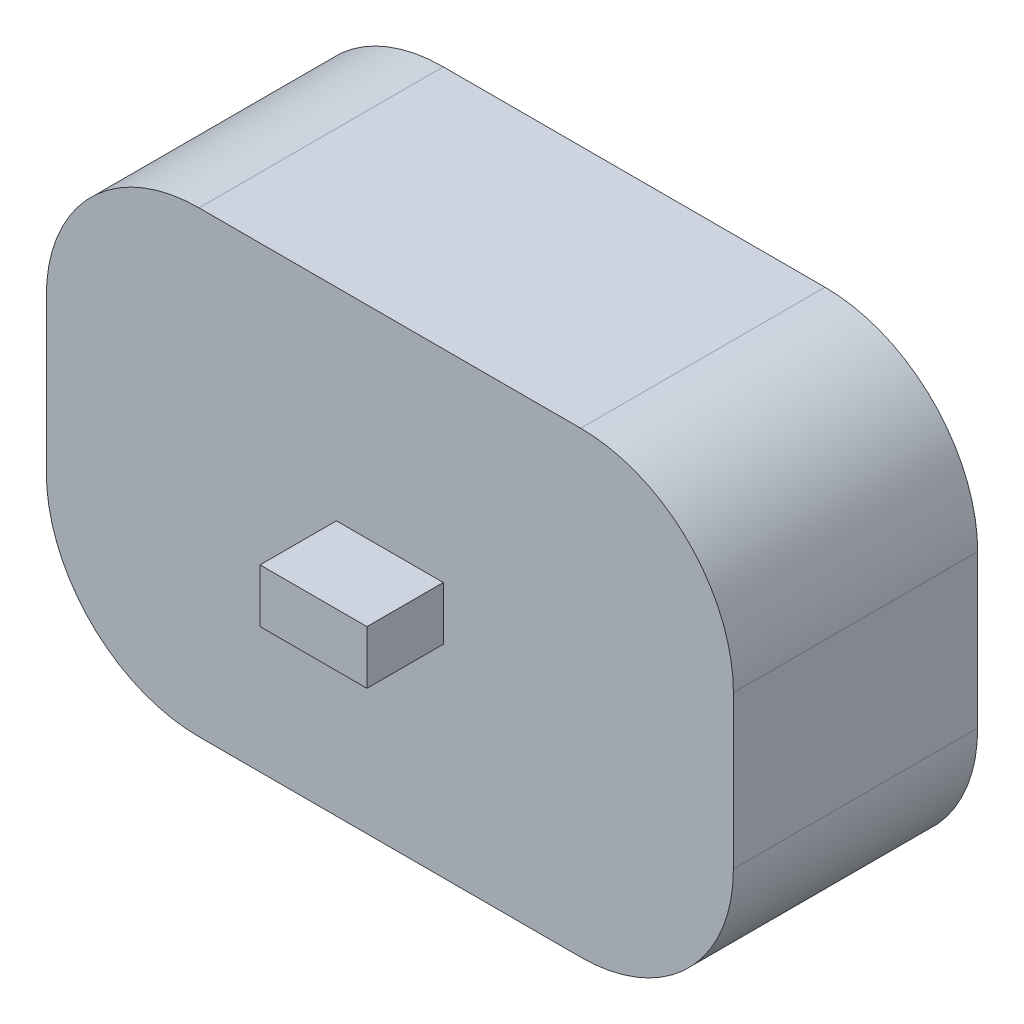
ISO-10303-21;
HEADER;
FILE_DESCRIPTION(('STEP AP214'),'2;1');
FILE_NAME('part.step','',(''),(''),'','','');
FILE_SCHEMA(('AUTOMOTIVE_DESIGN { 1 0 10303 214 1 1 1 1 }'));
ENDSEC;
DATA;
#1=APPLICATION_CONTEXT('core data for automotive mechanical design processes');
#2=APPLICATION_PROTOCOL_DEFINITION('international standard','automotive_design',2000,#1);
#3=PRODUCT_CONTEXT('',#1,'mechanical');
#4=PRODUCT('Part','Part','',(#3));
#5=PRODUCT_RELATED_PRODUCT_CATEGORY('part','',(#4));
#6=PRODUCT_DEFINITION_FORMATION('','',#4);
#7=PRODUCT_DEFINITION_CONTEXT('part definition',#1,'design');
#8=PRODUCT_DEFINITION('design','',#6,#7);
#9=PRODUCT_DEFINITION_SHAPE('','',#8);
#10=(LENGTH_UNIT() NAMED_UNIT(*) SI_UNIT(.MILLI.,.METRE.));
#11=(NAMED_UNIT(*) PLANE_ANGLE_UNIT() SI_UNIT($,.RADIAN.));
#12=(NAMED_UNIT(*) SI_UNIT($,.STERADIAN.) SOLID_ANGLE_UNIT());
#13=UNCERTAINTY_MEASURE_WITH_UNIT(LENGTH_MEASURE(1.E-05),#10,'distance_accuracy_value','');
#14=(GEOMETRIC_REPRESENTATION_CONTEXT(3) GLOBAL_UNCERTAINTY_ASSIGNED_CONTEXT((#13)) GLOBAL_UNIT_ASSIGNED_CONTEXT((#10,
#11,#12)) REPRESENTATION_CONTEXT('',''));
#15=CARTESIAN_POINT('',(0.,0.,0.));
#16=DIRECTION('',(0.,0.,1.));
#17=DIRECTION('',(1.,0.,0.));
#18=AXIS2_PLACEMENT_3D('',#15,#16,#17);
#19=CARTESIAN_POINT('',(22.5,-15.,16.));
#20=DIRECTION('',(-1.,0.,0.));
#21=DIRECTION('',(0.,0.,1.));
#22=AXIS2_PLACEMENT_3D('',#19,#20,#21);
#23=PLANE('',#22);
#24=DIRECTION('',(0.,1.,0.));
#25=VECTOR('',#24,1.);
#26=CARTESIAN_POINT('',(22.5,-15.,0.));
#27=LINE('',#26,#25);
#28=CARTESIAN_POINT('',(22.5,-5.,0.));
#29=VERTEX_POINT('',#28);
#30=CARTESIAN_POINT('',(22.5,5.,0.));
#31=VERTEX_POINT('',#30);
#32=EDGE_CURVE('E162',#29,#31,#27,.T.);
#33=ORIENTED_EDGE('',*,*,#32,.T.);
#34=DIRECTION('',(0.,0.,-1.));
#35=VECTOR('',#34,1.);
#36=CARTESIAN_POINT('',(22.5,5.,16.));
#37=LINE('',#36,#35);
#38=CARTESIAN_POINT('',(22.5,5.,16.));
#39=VERTEX_POINT('',#38);
#40=EDGE_CURVE('E215',#31,#39,#37,.F.);
#41=ORIENTED_EDGE('',*,*,#40,.T.);
#42=DIRECTION('',(0.,1.,0.));
#43=VECTOR('',#42,1.);
#44=CARTESIAN_POINT('',(22.5,-15.,16.));
#45=LINE('',#44,#43);
#46=CARTESIAN_POINT('',(22.5,-5.,16.));
#47=VERTEX_POINT('',#46);
#48=EDGE_CURVE('E167',#47,#39,#45,.T.);
#49=ORIENTED_EDGE('',*,*,#48,.F.);
#50=DIRECTION('',(0.,0.,-1.));
#51=VECTOR('',#50,1.);
#52=CARTESIAN_POINT('',(22.5,-5.,16.));
#53=LINE('',#52,#51);
#54=EDGE_CURVE('E212',#47,#29,#53,.T.);
#55=ORIENTED_EDGE('',*,*,#54,.T.);
#56=EDGE_LOOP('',(#33,#41,#49,#55));
#57=FACE_BOUND('',#56,.T.);
#58=ADVANCED_FACE('F36',(#57),#23,.F.);
#59=CARTESIAN_POINT('',(-22.5,15.,16.));
#60=DIRECTION('',(0.,-1.,0.));
#61=DIRECTION('',(0.,0.,-1.));
#62=AXIS2_PLACEMENT_3D('',#59,#60,#61);
#63=PLANE('',#62);
#64=DIRECTION('',(-1.,0.,0.));
#65=VECTOR('',#64,1.);
#66=CARTESIAN_POINT('',(-22.5,15.,0.));
#67=LINE('',#66,#65);
#68=CARTESIAN_POINT('',(12.5,15.,0.));
#69=VERTEX_POINT('',#68);
#70=CARTESIAN_POINT('',(-12.5,15.,0.));
#71=VERTEX_POINT('',#70);
#72=EDGE_CURVE('E181',#69,#71,#67,.T.);
#73=ORIENTED_EDGE('',*,*,#72,.T.);
#74=DIRECTION('',(0.,0.,-1.));
#75=VECTOR('',#74,1.);
#76=CARTESIAN_POINT('',(-12.5,15.,16.));
#77=LINE('',#76,#75);
#78=CARTESIAN_POINT('',(-12.5,15.,16.));
#79=VERTEX_POINT('',#78);
#80=EDGE_CURVE('E203',#71,#79,#77,.F.);
#81=ORIENTED_EDGE('',*,*,#80,.T.);
#82=DIRECTION('',(-1.,0.,0.));
#83=VECTOR('',#82,1.);
#84=CARTESIAN_POINT('',(-22.5,15.,16.));
#85=LINE('',#84,#83);
#86=CARTESIAN_POINT('',(12.5,15.,16.));
#87=VERTEX_POINT('',#86);
#88=EDGE_CURVE('E170',#87,#79,#85,.T.);
#89=ORIENTED_EDGE('',*,*,#88,.F.);
#90=DIRECTION('',(0.,0.,-1.));
#91=VECTOR('',#90,1.);
#92=CARTESIAN_POINT('',(12.5,15.,16.));
#93=LINE('',#92,#91);
#94=EDGE_CURVE('E200',#87,#69,#93,.T.);
#95=ORIENTED_EDGE('',*,*,#94,.T.);
#96=EDGE_LOOP('',(#73,#81,#89,#95));
#97=FACE_BOUND('',#96,.T.);
#98=ADVANCED_FACE('F240',(#97),#63,.F.);
#99=CARTESIAN_POINT('',(-22.5,-15.,16.));
#100=DIRECTION('',(1.,0.,0.));
#101=DIRECTION('',(0.,0.,-1.));
#102=AXIS2_PLACEMENT_3D('',#99,#100,#101);
#103=PLANE('',#102);
#104=DIRECTION('',(0.,-1.,0.));
#105=VECTOR('',#104,1.);
#106=CARTESIAN_POINT('',(-22.5,-15.,16.));
#107=LINE('',#106,#105);
#108=CARTESIAN_POINT('',(-22.5,5.,16.));
#109=VERTEX_POINT('',#108);
#110=CARTESIAN_POINT('',(-22.5,-5.,16.));
#111=VERTEX_POINT('',#110);
#112=EDGE_CURVE('E174',#109,#111,#107,.T.);
#113=ORIENTED_EDGE('',*,*,#112,.F.);
#114=DIRECTION('',(0.,0.,-1.));
#115=VECTOR('',#114,1.);
#116=CARTESIAN_POINT('',(-22.5,5.,16.));
#117=LINE('',#116,#115);
#118=CARTESIAN_POINT('',(-22.5,5.,0.));
#119=VERTEX_POINT('',#118);
#120=EDGE_CURVE('E189',#109,#119,#117,.T.);
#121=ORIENTED_EDGE('',*,*,#120,.T.);
#122=DIRECTION('',(0.,-1.,0.));
#123=VECTOR('',#122,1.);
#124=CARTESIAN_POINT('',(-22.5,-15.,0.));
#125=LINE('',#124,#123);
#126=CARTESIAN_POINT('',(-22.5,-5.,0.));
#127=VERTEX_POINT('',#126);
#128=EDGE_CURVE('E184',#119,#127,#125,.T.);
#129=ORIENTED_EDGE('',*,*,#128,.T.);
#130=DIRECTION('',(0.,0.,-1.));
#131=VECTOR('',#130,1.);
#132=CARTESIAN_POINT('',(-22.5,-5.,16.));
#133=LINE('',#132,#131);
#134=EDGE_CURVE('E178',#127,#111,#133,.F.);
#135=ORIENTED_EDGE('',*,*,#134,.T.);
#136=EDGE_LOOP('',(#113,#121,#129,#135));
#137=FACE_BOUND('',#136,.T.);
#138=ADVANCED_FACE('F248',(#137),#103,.F.);
#139=CARTESIAN_POINT('',(-22.5,-15.,16.));
#140=DIRECTION('',(0.,1.,0.));
#141=DIRECTION('',(-1.,0.,0.));
#142=AXIS2_PLACEMENT_3D('',#139,#140,#141);
#143=PLANE('',#142);
#144=DIRECTION('',(1.,0.,0.));
#145=VECTOR('',#144,1.);
#146=CARTESIAN_POINT('',(-22.5,-15.,0.));
#147=LINE('',#146,#145);
#148=CARTESIAN_POINT('',(-12.5,-15.,0.));
#149=VERTEX_POINT('',#148);
#150=CARTESIAN_POINT('',(12.5,-15.,0.));
#151=VERTEX_POINT('',#150);
#152=EDGE_CURVE('E171',#149,#151,#147,.T.);
#153=ORIENTED_EDGE('',*,*,#152,.T.);
#154=DIRECTION('',(0.,0.,-1.));
#155=VECTOR('',#154,1.);
#156=CARTESIAN_POINT('',(12.5,-15.,16.));
#157=LINE('',#156,#155);
#158=CARTESIAN_POINT('',(12.5,-15.,16.));
#159=VERTEX_POINT('',#158);
#160=EDGE_CURVE('E11',#151,#159,#157,.F.);
#161=ORIENTED_EDGE('',*,*,#160,.T.);
#162=DIRECTION('',(1.,0.,0.));
#163=VECTOR('',#162,1.);
#164=CARTESIAN_POINT('',(-22.5,-15.,16.));
#165=LINE('',#164,#163);
#166=CARTESIAN_POINT('',(-12.5,-15.,16.));
#167=VERTEX_POINT('',#166);
#168=EDGE_CURVE('E176',#167,#159,#165,.T.);
#169=ORIENTED_EDGE('',*,*,#168,.F.);
#170=DIRECTION('',(0.,0.,-1.));
#171=VECTOR('',#170,1.);
#172=CARTESIAN_POINT('',(-12.5,-15.,16.));
#173=LINE('',#172,#171);
#174=EDGE_CURVE('E44',#167,#149,#173,.T.);
#175=ORIENTED_EDGE('',*,*,#174,.T.);
#176=EDGE_LOOP('',(#153,#161,#169,#175));
#177=FACE_BOUND('',#176,.T.);
#178=ADVANCED_FACE('F219',(#177),#143,.F.);
#179=CARTESIAN_POINT('',(0.,0.,16.));
#180=DIRECTION('',(0.,0.,-1.));
#181=DIRECTION('',(-1.,0.,0.));
#182=AXIS2_PLACEMENT_3D('',#179,#180,#181);
#183=PLANE('',#182);
#184=DIRECTION('',(-1.,0.,0.));
#185=VECTOR('',#184,1.);
#186=CARTESIAN_POINT('',(3.5,1.74999999999999,16.));
#187=LINE('',#186,#185);
#188=CARTESIAN_POINT('',(3.5,1.74999999999999,16.));
#189=VERTEX_POINT('',#188);
#190=CARTESIAN_POINT('',(-3.5,1.74999999999999,16.));
#191=VERTEX_POINT('',#190);
#192=EDGE_CURVE('E150',#189,#191,#187,.T.);
#193=ORIENTED_EDGE('',*,*,#192,.F.);
#194=DIRECTION('',(0.,-1.,0.));
#195=VECTOR('',#194,1.);
#196=CARTESIAN_POINT('',(3.5,1.74999999999999,16.));
#197=LINE('',#196,#195);
#198=CARTESIAN_POINT('',(3.5,-1.74999999999999,16.));
#199=VERTEX_POINT('',#198);
#200=EDGE_CURVE('E157',#189,#199,#197,.T.);
#201=ORIENTED_EDGE('',*,*,#200,.T.);
#202=DIRECTION('',(-1.,0.,0.));
#203=VECTOR('',#202,1.);
#204=CARTESIAN_POINT('',(3.5,-1.74999999999999,16.));
#205=LINE('',#204,#203);
#206=CARTESIAN_POINT('',(-3.5,-1.74999999999999,16.));
#207=VERTEX_POINT('',#206);
#208=EDGE_CURVE('E131',#199,#207,#205,.T.);
#209=ORIENTED_EDGE('',*,*,#208,.T.);
#210=DIRECTION('',(0.,-1.,0.));
#211=VECTOR('',#210,1.);
#212=CARTESIAN_POINT('',(-3.5,1.74999999999999,16.));
#213=LINE('',#212,#211);
#214=EDGE_CURVE('E152',#191,#207,#213,.T.);
#215=ORIENTED_EDGE('',*,*,#214,.F.);
#216=EDGE_LOOP('',(#193,#201,#209,#215));
#217=FACE_BOUND('',#216,.T.);
#218=ORIENTED_EDGE('',*,*,#88,.T.);
#219=CARTESIAN_POINT('',(-12.5,5.,16.));
#220=DIRECTION('',(0.,0.,-1.));
#221=DIRECTION('',(-1.,0.,0.));
#222=AXIS2_PLACEMENT_3D('',#219,#220,#221);
#223=CIRCLE('',#222,10.);
#224=EDGE_CURVE('E210',#79,#109,#223,.F.);
#225=ORIENTED_EDGE('',*,*,#224,.T.);
#226=ORIENTED_EDGE('',*,*,#112,.T.);
#227=CARTESIAN_POINT('',(-12.5,-5.,16.));
#228=DIRECTION('',(0.,0.,-1.));
#229=DIRECTION('',(-1.,0.,0.));
#230=AXIS2_PLACEMENT_3D('',#227,#228,#229);
#231=CIRCLE('',#230,10.);
#232=EDGE_CURVE('E56',#111,#167,#231,.F.);
#233=ORIENTED_EDGE('',*,*,#232,.T.);
#234=ORIENTED_EDGE('',*,*,#168,.T.);
#235=CARTESIAN_POINT('',(12.5,-5.,16.));
#236=DIRECTION('',(0.,0.,-1.));
#237=DIRECTION('',(-1.,0.,0.));
#238=AXIS2_PLACEMENT_3D('',#235,#236,#237);
#239=CIRCLE('',#238,10.);
#240=EDGE_CURVE('E206',#159,#47,#239,.F.);
#241=ORIENTED_EDGE('',*,*,#240,.T.);
#242=ORIENTED_EDGE('',*,*,#48,.T.);
#243=CARTESIAN_POINT('',(12.5,5.,16.));
#244=DIRECTION('',(0.,0.,-1.));
#245=DIRECTION('',(-1.,0.,0.));
#246=AXIS2_PLACEMENT_3D('',#243,#244,#245);
#247=CIRCLE('',#246,10.);
#248=EDGE_CURVE('E208',#39,#87,#247,.F.);
#249=ORIENTED_EDGE('',*,*,#248,.T.);
#250=EDGE_LOOP('',(#218,#225,#226,#233,#234,#241,#242,#249));
#251=FACE_BOUND('',#250,.T.);
#252=ADVANCED_FACE('F233',(#217,#251),#183,.F.);
#253=CARTESIAN_POINT('',(0.,0.,0.));
#254=DIRECTION('',(0.,0.,-1.));
#255=DIRECTION('',(-1.,0.,0.));
#256=AXIS2_PLACEMENT_3D('',#253,#254,#255);
#257=PLANE('',#256);
#258=ORIENTED_EDGE('',*,*,#128,.F.);
#259=CARTESIAN_POINT('',(-12.5,5.,0.));
#260=DIRECTION('',(0.,0.,-1.));
#261=DIRECTION('',(-1.,0.,0.));
#262=AXIS2_PLACEMENT_3D('',#259,#260,#261);
#263=CIRCLE('',#262,10.);
#264=EDGE_CURVE('E198',#119,#71,#263,.T.);
#265=ORIENTED_EDGE('',*,*,#264,.T.);
#266=ORIENTED_EDGE('',*,*,#72,.F.);
#267=CARTESIAN_POINT('',(12.5,5.,0.));
#268=DIRECTION('',(0.,0.,-1.));
#269=DIRECTION('',(-1.,0.,0.));
#270=AXIS2_PLACEMENT_3D('',#267,#268,#269);
#271=CIRCLE('',#270,10.);
#272=EDGE_CURVE('E196',#69,#31,#271,.T.);
#273=ORIENTED_EDGE('',*,*,#272,.T.);
#274=ORIENTED_EDGE('',*,*,#32,.F.);
#275=CARTESIAN_POINT('',(12.5,-5.,0.));
#276=DIRECTION('',(0.,0.,-1.));
#277=DIRECTION('',(-1.,0.,0.));
#278=AXIS2_PLACEMENT_3D('',#275,#276,#277);
#279=CIRCLE('',#278,10.);
#280=EDGE_CURVE('E194',#29,#151,#279,.T.);
#281=ORIENTED_EDGE('',*,*,#280,.T.);
#282=ORIENTED_EDGE('',*,*,#152,.F.);
#283=CARTESIAN_POINT('',(-12.5,-5.,0.));
#284=DIRECTION('',(0.,0.,-1.));
#285=DIRECTION('',(-1.,0.,0.));
#286=AXIS2_PLACEMENT_3D('',#283,#284,#285);
#287=CIRCLE('',#286,10.);
#288=EDGE_CURVE('E192',#149,#127,#287,.T.);
#289=ORIENTED_EDGE('',*,*,#288,.T.);
#290=EDGE_LOOP('',(#258,#265,#266,#273,#274,#281,#282,#289));
#291=FACE_BOUND('',#290,.T.);
#292=ADVANCED_FACE('F223',(#291),#257,.T.);
#293=CARTESIAN_POINT('',(3.5,1.74999999999999,21.));
#294=DIRECTION('',(1.,0.,0.));
#295=DIRECTION('',(0.,0.,-1.));
#296=AXIS2_PLACEMENT_3D('',#293,#294,#295);
#297=PLANE('',#296);
#298=ORIENTED_EDGE('',*,*,#200,.F.);
#299=DIRECTION('',(0.,0.,-1.));
#300=VECTOR('',#299,1.);
#301=CARTESIAN_POINT('',(3.5,1.74999999999999,21.));
#302=LINE('',#301,#300);
#303=CARTESIAN_POINT('',(3.5,1.74999999999999,21.));
#304=VERTEX_POINT('',#303);
#305=EDGE_CURVE('E148',#304,#189,#302,.T.);
#306=ORIENTED_EDGE('',*,*,#305,.F.);
#307=DIRECTION('',(0.,-1.,0.));
#308=VECTOR('',#307,1.);
#309=CARTESIAN_POINT('',(3.5,1.74999999999999,21.));
#310=LINE('',#309,#308);
#311=CARTESIAN_POINT('',(3.5,-1.74999999999999,21.));
#312=VERTEX_POINT('',#311);
#313=EDGE_CURVE('E142',#304,#312,#310,.T.);
#314=ORIENTED_EDGE('',*,*,#313,.T.);
#315=DIRECTION('',(0.,0.,-1.));
#316=VECTOR('',#315,1.);
#317=CARTESIAN_POINT('',(3.5,-1.74999999999999,21.));
#318=LINE('',#317,#316);
#319=EDGE_CURVE('E125',#312,#199,#318,.T.);
#320=ORIENTED_EDGE('',*,*,#319,.T.);
#321=EDGE_LOOP('',(#298,#306,#314,#320));
#322=FACE_BOUND('',#321,.T.);
#323=ADVANCED_FACE('F147',(#322),#297,.T.);
#324=CARTESIAN_POINT('',(3.5,1.74999999999999,21.));
#325=DIRECTION('',(0.,-1.,0.));
#326=DIRECTION('',(0.,0.,-1.));
#327=AXIS2_PLACEMENT_3D('',#324,#325,#326);
#328=PLANE('',#327);
#329=ORIENTED_EDGE('',*,*,#192,.T.);
#330=DIRECTION('',(0.,0.,-1.));
#331=VECTOR('',#330,1.);
#332=CARTESIAN_POINT('',(-3.5,1.74999999999999,21.));
#333=LINE('',#332,#331);
#334=CARTESIAN_POINT('',(-3.5,1.74999999999999,21.));
#335=VERTEX_POINT('',#334);
#336=EDGE_CURVE('E163',#335,#191,#333,.T.);
#337=ORIENTED_EDGE('',*,*,#336,.F.);
#338=DIRECTION('',(-1.,0.,0.));
#339=VECTOR('',#338,1.);
#340=CARTESIAN_POINT('',(3.5,1.74999999999999,21.));
#341=LINE('',#340,#339);
#342=EDGE_CURVE('E137',#304,#335,#341,.T.);
#343=ORIENTED_EDGE('',*,*,#342,.F.);
#344=ORIENTED_EDGE('',*,*,#305,.T.);
#345=EDGE_LOOP('',(#329,#337,#343,#344));
#346=FACE_BOUND('',#345,.T.);
#347=ADVANCED_FACE('F309',(#346),#328,.F.);
#348=CARTESIAN_POINT('',(-3.5,1.74999999999999,21.));
#349=DIRECTION('',(1.,0.,0.));
#350=DIRECTION('',(0.,0.,-1.));
#351=AXIS2_PLACEMENT_3D('',#348,#349,#350);
#352=PLANE('',#351);
#353=ORIENTED_EDGE('',*,*,#214,.T.);
#354=DIRECTION('',(0.,0.,-1.));
#355=VECTOR('',#354,1.);
#356=CARTESIAN_POINT('',(-3.5,-1.74999999999999,21.));
#357=LINE('',#356,#355);
#358=CARTESIAN_POINT('',(-3.5,-1.74999999999999,21.));
#359=VERTEX_POINT('',#358);
#360=EDGE_CURVE('E136',#359,#207,#357,.T.);
#361=ORIENTED_EDGE('',*,*,#360,.F.);
#362=DIRECTION('',(0.,-1.,0.));
#363=VECTOR('',#362,1.);
#364=CARTESIAN_POINT('',(-3.5,1.74999999999999,21.));
#365=LINE('',#364,#363);
#366=EDGE_CURVE('E144',#335,#359,#365,.T.);
#367=ORIENTED_EDGE('',*,*,#366,.F.);
#368=ORIENTED_EDGE('',*,*,#336,.T.);
#369=EDGE_LOOP('',(#353,#361,#367,#368));
#370=FACE_BOUND('',#369,.T.);
#371=ADVANCED_FACE('F301',(#370),#352,.F.);
#372=CARTESIAN_POINT('',(3.5,-1.74999999999999,21.));
#373=DIRECTION('',(0.,-1.,0.));
#374=DIRECTION('',(0.,0.,-1.));
#375=AXIS2_PLACEMENT_3D('',#372,#373,#374);
#376=PLANE('',#375);
#377=ORIENTED_EDGE('',*,*,#208,.F.);
#378=ORIENTED_EDGE('',*,*,#319,.F.);
#379=DIRECTION('',(-1.,0.,0.));
#380=VECTOR('',#379,1.);
#381=CARTESIAN_POINT('',(3.5,-1.74999999999999,21.));
#382=LINE('',#381,#380);
#383=EDGE_CURVE('E129',#312,#359,#382,.T.);
#384=ORIENTED_EDGE('',*,*,#383,.T.);
#385=ORIENTED_EDGE('',*,*,#360,.T.);
#386=EDGE_LOOP('',(#377,#378,#384,#385));
#387=FACE_BOUND('',#386,.T.);
#388=ADVANCED_FACE('F127',(#387),#376,.T.);
#389=CARTESIAN_POINT('',(0.,0.,21.));
#390=DIRECTION('',(0.,0.,-1.));
#391=DIRECTION('',(-1.,0.,0.));
#392=AXIS2_PLACEMENT_3D('',#389,#390,#391);
#393=PLANE('',#392);
#394=ORIENTED_EDGE('',*,*,#313,.F.);
#395=ORIENTED_EDGE('',*,*,#342,.T.);
#396=ORIENTED_EDGE('',*,*,#366,.T.);
#397=ORIENTED_EDGE('',*,*,#383,.F.);
#398=EDGE_LOOP('',(#394,#395,#396,#397));
#399=FACE_BOUND('',#398,.T.);
#400=ADVANCED_FACE('F141',(#399),#393,.F.);
#401=CARTESIAN_POINT('',(-12.5,5.,16.));
#402=DIRECTION('',(0.,0.,-1.));
#403=DIRECTION('',(-1.,0.,0.));
#404=AXIS2_PLACEMENT_3D('',#401,#402,#403);
#405=CYLINDRICAL_SURFACE('',#404,10.);
#406=ORIENTED_EDGE('',*,*,#224,.F.);
#407=ORIENTED_EDGE('',*,*,#80,.F.);
#408=ORIENTED_EDGE('',*,*,#264,.F.);
#409=ORIENTED_EDGE('',*,*,#120,.F.);
#410=EDGE_LOOP('',(#406,#407,#408,#409));
#411=FACE_BOUND('',#410,.T.);
#412=ADVANCED_FACE('F245',(#411),#405,.T.);
#413=CARTESIAN_POINT('',(12.5,5.,16.));
#414=DIRECTION('',(0.,0.,-1.));
#415=DIRECTION('',(-1.,0.,0.));
#416=AXIS2_PLACEMENT_3D('',#413,#414,#415);
#417=CYLINDRICAL_SURFACE('',#416,10.);
#418=ORIENTED_EDGE('',*,*,#248,.F.);
#419=ORIENTED_EDGE('',*,*,#40,.F.);
#420=ORIENTED_EDGE('',*,*,#272,.F.);
#421=ORIENTED_EDGE('',*,*,#94,.F.);
#422=EDGE_LOOP('',(#418,#419,#420,#421));
#423=FACE_BOUND('',#422,.T.);
#424=ADVANCED_FACE('F237',(#423),#417,.T.);
#425=CARTESIAN_POINT('',(12.5,-5.,16.));
#426=DIRECTION('',(0.,0.,-1.));
#427=DIRECTION('',(-1.,0.,0.));
#428=AXIS2_PLACEMENT_3D('',#425,#426,#427);
#429=CYLINDRICAL_SURFACE('',#428,10.);
#430=ORIENTED_EDGE('',*,*,#240,.F.);
#431=ORIENTED_EDGE('',*,*,#160,.F.);
#432=ORIENTED_EDGE('',*,*,#280,.F.);
#433=ORIENTED_EDGE('',*,*,#54,.F.);
#434=EDGE_LOOP('',(#430,#431,#432,#433));
#435=FACE_BOUND('',#434,.T.);
#436=ADVANCED_FACE('F228',(#435),#429,.T.);
#437=CARTESIAN_POINT('',(-12.5,-5.,16.));
#438=DIRECTION('',(0.,0.,-1.));
#439=DIRECTION('',(-1.,0.,0.));
#440=AXIS2_PLACEMENT_3D('',#437,#438,#439);
#441=CYLINDRICAL_SURFACE('',#440,10.);
#442=ORIENTED_EDGE('',*,*,#232,.F.);
#443=ORIENTED_EDGE('',*,*,#134,.F.);
#444=ORIENTED_EDGE('',*,*,#288,.F.);
#445=ORIENTED_EDGE('',*,*,#174,.F.);
#446=EDGE_LOOP('',(#442,#443,#444,#445));
#447=FACE_BOUND('',#446,.T.);
#448=ADVANCED_FACE('F38',(#447),#441,.T.);
#449=CLOSED_SHELL('',(#58,#98,#138,#178,#252,#292,#323,#347,#371,#388,#400,#412,#424,#436,#448));
#450=MANIFOLD_SOLID_BREP('B2',#449);
#451=ADVANCED_BREP_SHAPE_REPRESENTATION('',(#18,#450),#14);
#452=SHAPE_DEFINITION_REPRESENTATION(#9,#451);
ENDSEC;
END-ISO-10303-21;
